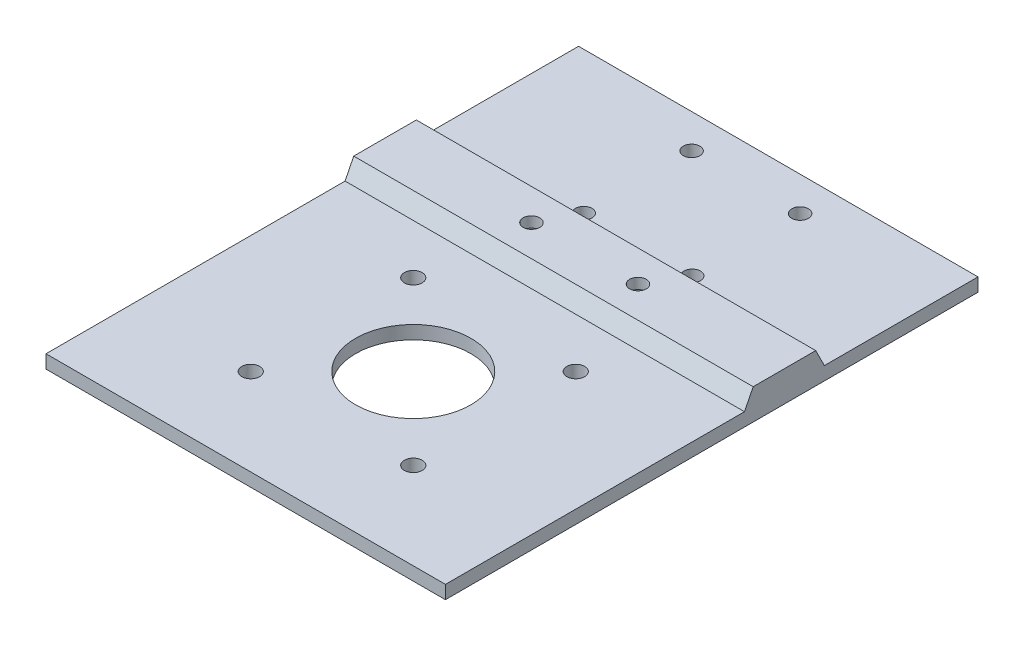
ISO-10303-21;
HEADER;
FILE_DESCRIPTION(('STEP AP214'),'2;1');
FILE_NAME('part.step','',(''),(''),'','','');
FILE_SCHEMA(('AUTOMOTIVE_DESIGN { 1 0 10303 214 1 1 1 1 }'));
ENDSEC;
DATA;
#1=APPLICATION_CONTEXT('core data for automotive mechanical design processes');
#2=APPLICATION_PROTOCOL_DEFINITION('international standard','automotive_design',2000,#1);
#3=PRODUCT_CONTEXT('',#1,'mechanical');
#4=PRODUCT('Part','Part','',(#3));
#5=PRODUCT_RELATED_PRODUCT_CATEGORY('part','',(#4));
#6=PRODUCT_DEFINITION_FORMATION('','',#4);
#7=PRODUCT_DEFINITION_CONTEXT('part definition',#1,'design');
#8=PRODUCT_DEFINITION('design','',#6,#7);
#9=PRODUCT_DEFINITION_SHAPE('','',#8);
#10=(LENGTH_UNIT() NAMED_UNIT(*) SI_UNIT(.MILLI.,.METRE.));
#11=(NAMED_UNIT(*) PLANE_ANGLE_UNIT() SI_UNIT($,.RADIAN.));
#12=(NAMED_UNIT(*) SI_UNIT($,.STERADIAN.) SOLID_ANGLE_UNIT());
#13=UNCERTAINTY_MEASURE_WITH_UNIT(LENGTH_MEASURE(1.E-05),#10,'distance_accuracy_value','');
#14=(GEOMETRIC_REPRESENTATION_CONTEXT(3) GLOBAL_UNCERTAINTY_ASSIGNED_CONTEXT((#13)) GLOBAL_UNIT_ASSIGNED_CONTEXT((#10,
#11,#12)) REPRESENTATION_CONTEXT('',''));
#15=CARTESIAN_POINT('',(0.,0.,0.));
#16=DIRECTION('',(0.,0.,1.));
#17=DIRECTION('',(1.,0.,0.));
#18=AXIS2_PLACEMENT_3D('',#15,#16,#17);
#19=CARTESIAN_POINT('',(0.,2.54,0.));
#20=DIRECTION('',(0.,-1.,0.));
#21=DIRECTION('',(0.,0.,-1.));
#22=AXIS2_PLACEMENT_3D('',#19,#20,#21);
#23=PLANE('',#22);
#24=CARTESIAN_POINT('',(10.6671992353835,2.54,-44.2920663903966));
#25=DIRECTION('',(0.,1.,0.));
#26=DIRECTION('',(0.,0.,1.));
#27=AXIS2_PLACEMENT_3D('',#24,#25,#26);
#28=CIRCLE('',#27,1.5875);
#29=CARTESIAN_POINT('',(10.6671992353835,2.54,-42.7045663903966));
#30=VERTEX_POINT('',#29);
#31=EDGE_CURVE('E205',#30,#30,#28,.T.);
#32=ORIENTED_EDGE('',*,*,#31,.F.);
#33=EDGE_LOOP('',(#32));
#34=FACE_BOUND('',#33,.T.);
#35=CARTESIAN_POINT('',(10.6671992353835,2.54,-23.7165663903966));
#36=DIRECTION('',(0.,1.,0.));
#37=DIRECTION('',(0.,0.,1.));
#38=AXIS2_PLACEMENT_3D('',#35,#36,#37);
#39=CIRCLE('',#38,1.5875);
#40=CARTESIAN_POINT('',(10.6671992353835,2.54,-22.1290663903966));
#41=VERTEX_POINT('',#40);
#42=EDGE_CURVE('E215',#41,#41,#39,.T.);
#43=ORIENTED_EDGE('',*,*,#42,.F.);
#44=EDGE_LOOP('',(#43));
#45=FACE_BOUND('',#44,.T.);
#46=CARTESIAN_POINT('',(-10.0338007646165,2.54,-23.7165663903966));
#47=DIRECTION('',(0.,1.,0.));
#48=DIRECTION('',(0.,0.,1.));
#49=AXIS2_PLACEMENT_3D('',#46,#47,#48);
#50=CIRCLE('',#49,1.5875);
#51=CARTESIAN_POINT('',(-10.0338007646165,2.54,-22.1290663903966));
#52=VERTEX_POINT('',#51);
#53=EDGE_CURVE('E223',#52,#52,#50,.T.);
#54=ORIENTED_EDGE('',*,*,#53,.F.);
#55=EDGE_LOOP('',(#54));
#56=FACE_BOUND('',#55,.T.);
#57=CARTESIAN_POINT('',(-10.0338007646165,2.54,-44.2920663903966));
#58=DIRECTION('',(0.,1.,0.));
#59=DIRECTION('',(0.,0.,1.));
#60=AXIS2_PLACEMENT_3D('',#57,#58,#59);
#61=CIRCLE('',#60,1.5875);
#62=CARTESIAN_POINT('',(-10.0338007646165,2.54,-42.7045663903966));
#63=VERTEX_POINT('',#62);
#64=EDGE_CURVE('E214',#63,#63,#61,.T.);
#65=ORIENTED_EDGE('',*,*,#64,.F.);
#66=EDGE_LOOP('',(#65));
#67=FACE_BOUND('',#66,.T.);
#68=DIRECTION('',(-1.,0.,0.));
#69=VECTOR('',#68,1.);
#70=CARTESIAN_POINT('',(53.6936142058216,2.54000000000001,-21.4940663903966));
#71=LINE('',#70,#69);
#72=CARTESIAN_POINT('',(38.1,2.54000000000001,-21.4940663903966));
#73=VERTEX_POINT('',#72);
#74=CARTESIAN_POINT('',(-38.1,2.54000000000001,-21.4940663903966));
#75=VERTEX_POINT('',#74);
#76=EDGE_CURVE('E151',#73,#75,#71,.T.);
#77=ORIENTED_EDGE('',*,*,#76,.F.);
#78=DIRECTION('',(0.,0.,-1.));
#79=VECTOR('',#78,1.);
#80=CARTESIAN_POINT('',(38.1,2.54,50.8));
#81=LINE('',#80,#79);
#82=CARTESIAN_POINT('',(38.1,2.54,-50.8));
#83=VERTEX_POINT('',#82);
#84=EDGE_CURVE('E98',#73,#83,#81,.T.);
#85=ORIENTED_EDGE('',*,*,#84,.T.);
#86=DIRECTION('',(-1.,0.,0.));
#87=VECTOR('',#86,1.);
#88=CARTESIAN_POINT('',(-38.1,2.54,-50.8));
#89=LINE('',#88,#87);
#90=CARTESIAN_POINT('',(-38.1,2.54,-50.8));
#91=VERTEX_POINT('',#90);
#92=EDGE_CURVE('E248',#83,#91,#89,.T.);
#93=ORIENTED_EDGE('',*,*,#92,.T.);
#94=DIRECTION('',(0.,0.,1.));
#95=VECTOR('',#94,1.);
#96=CARTESIAN_POINT('',(-38.1,2.54,50.8));
#97=LINE('',#96,#95);
#98=EDGE_CURVE('E252',#91,#75,#97,.T.);
#99=ORIENTED_EDGE('',*,*,#98,.T.);
#100=EDGE_LOOP('',(#77,#85,#93,#99));
#101=FACE_BOUND('',#100,.T.);
#102=ADVANCED_FACE('F39',(#34,#45,#56,#67,#101),#23,.F.);
#103=CARTESIAN_POINT('',(38.1,2.54,50.8));
#104=DIRECTION('',(-1.,0.,0.));
#105=DIRECTION('',(0.,0.,1.));
#106=AXIS2_PLACEMENT_3D('',#103,#104,#105);
#107=PLANE('',#106);
#108=DIRECTION('',(0.,0.,-1.));
#109=VECTOR('',#108,1.);
#110=CARTESIAN_POINT('',(38.1,0.,50.8));
#111=LINE('',#110,#109);
#112=CARTESIAN_POINT('',(38.1,0.,50.8));
#113=VERTEX_POINT('',#112);
#114=CARTESIAN_POINT('',(38.1,0.,-50.8));
#115=VERTEX_POINT('',#114);
#116=EDGE_CURVE('E244',#113,#115,#111,.T.);
#117=ORIENTED_EDGE('',*,*,#116,.T.);
#118=DIRECTION('',(0.,-1.,0.));
#119=VECTOR('',#118,1.);
#120=CARTESIAN_POINT('',(38.1,2.54,-50.8));
#121=LINE('',#120,#119);
#122=EDGE_CURVE('E11',#83,#115,#121,.T.);
#123=ORIENTED_EDGE('',*,*,#122,.F.);
#124=ORIENTED_EDGE('',*,*,#84,.F.);
#125=DIRECTION('',(0.,-0.894427190999916,-0.447213595499959));
#126=VECTOR('',#125,1.);
#127=CARTESIAN_POINT('',(38.1,2.54000000000001,-21.4940663903966));
#128=LINE('',#127,#126);
#129=CARTESIAN_POINT('',(38.1,5.84200000000001,-19.8430663903966));
#130=VERTEX_POINT('',#129);
#131=EDGE_CURVE('E161',#130,#73,#128,.T.);
#132=ORIENTED_EDGE('',*,*,#131,.F.);
#133=DIRECTION('',(0.,0.,-1.));
#134=VECTOR('',#133,1.);
#135=CARTESIAN_POINT('',(38.1,5.84200000000001,-19.8430663903966));
#136=LINE('',#135,#134);
#137=CARTESIAN_POINT('',(38.1,5.842,-7.90506639039663));
#138=VERTEX_POINT('',#137);
#139=EDGE_CURVE('E134',#138,#130,#136,.T.);
#140=ORIENTED_EDGE('',*,*,#139,.F.);
#141=DIRECTION('',(0.,0.894427190999916,-0.447213595499958));
#142=VECTOR('',#141,1.);
#143=CARTESIAN_POINT('',(38.1,5.842,-7.90506639039663));
#144=LINE('',#143,#142);
#145=CARTESIAN_POINT('',(38.1,2.54,-6.25406639039663));
#146=VERTEX_POINT('',#145);
#147=EDGE_CURVE('E138',#146,#138,#144,.T.);
#148=ORIENTED_EDGE('',*,*,#147,.F.);
#149=CARTESIAN_POINT('',(38.1,2.54,50.8));
#150=VERTEX_POINT('',#149);
#151=EDGE_CURVE('E245',#150,#146,#81,.T.);
#152=ORIENTED_EDGE('',*,*,#151,.F.);
#153=DIRECTION('',(0.,-1.,0.));
#154=VECTOR('',#153,1.);
#155=CARTESIAN_POINT('',(38.1,2.54,50.8));
#156=LINE('',#155,#154);
#157=EDGE_CURVE('E256',#150,#113,#156,.T.);
#158=ORIENTED_EDGE('',*,*,#157,.T.);
#159=EDGE_LOOP('',(#117,#123,#124,#132,#140,#148,#152,#158));
#160=FACE_BOUND('',#159,.T.);
#161=ADVANCED_FACE('F41',(#160),#107,.F.);
#162=CARTESIAN_POINT('',(-38.1,2.54,-50.8));
#163=DIRECTION('',(0.,0.,1.));
#164=DIRECTION('',(1.,0.,0.));
#165=AXIS2_PLACEMENT_3D('',#162,#163,#164);
#166=PLANE('',#165);
#167=DIRECTION('',(-1.,0.,0.));
#168=VECTOR('',#167,1.);
#169=CARTESIAN_POINT('',(-38.1,0.,-50.8));
#170=LINE('',#169,#168);
#171=CARTESIAN_POINT('',(-38.1,0.,-50.8));
#172=VERTEX_POINT('',#171);
#173=EDGE_CURVE('E260',#115,#172,#170,.T.);
#174=ORIENTED_EDGE('',*,*,#173,.T.);
#175=DIRECTION('',(0.,-1.,0.));
#176=VECTOR('',#175,1.);
#177=CARTESIAN_POINT('',(-38.1,2.54,-50.8));
#178=LINE('',#177,#176);
#179=EDGE_CURVE('E47',#91,#172,#178,.T.);
#180=ORIENTED_EDGE('',*,*,#179,.F.);
#181=ORIENTED_EDGE('',*,*,#92,.F.);
#182=ORIENTED_EDGE('',*,*,#122,.T.);
#183=EDGE_LOOP('',(#174,#180,#181,#182));
#184=FACE_BOUND('',#183,.T.);
#185=ADVANCED_FACE('F365',(#184),#166,.F.);
#186=CARTESIAN_POINT('',(-38.1,2.54,50.8));
#187=DIRECTION('',(1.,0.,0.));
#188=DIRECTION('',(0.,0.,-1.));
#189=AXIS2_PLACEMENT_3D('',#186,#187,#188);
#190=PLANE('',#189);
#191=DIRECTION('',(0.,0.,1.));
#192=VECTOR('',#191,1.);
#193=CARTESIAN_POINT('',(-38.1,0.,50.8));
#194=LINE('',#193,#192);
#195=CARTESIAN_POINT('',(-38.1,0.,50.8));
#196=VERTEX_POINT('',#195);
#197=EDGE_CURVE('E263',#172,#196,#194,.T.);
#198=ORIENTED_EDGE('',*,*,#197,.T.);
#199=DIRECTION('',(0.,-1.,0.));
#200=VECTOR('',#199,1.);
#201=CARTESIAN_POINT('',(-38.1,2.54,50.8));
#202=LINE('',#201,#200);
#203=CARTESIAN_POINT('',(-38.1,2.54,50.8));
#204=VERTEX_POINT('',#203);
#205=EDGE_CURVE('E269',#204,#196,#202,.T.);
#206=ORIENTED_EDGE('',*,*,#205,.F.);
#207=CARTESIAN_POINT('',(-38.1,2.54,-6.25406639039663));
#208=VERTEX_POINT('',#207);
#209=EDGE_CURVE('E251',#208,#204,#97,.T.);
#210=ORIENTED_EDGE('',*,*,#209,.F.);
#211=DIRECTION('',(0.,-0.894427190999916,0.447213595499958));
#212=VECTOR('',#211,1.);
#213=CARTESIAN_POINT('',(-38.1,5.842,-7.90506639039663));
#214=LINE('',#213,#212);
#215=CARTESIAN_POINT('',(-38.1,5.842,-7.90506639039663));
#216=VERTEX_POINT('',#215);
#217=EDGE_CURVE('E57',#216,#208,#214,.T.);
#218=ORIENTED_EDGE('',*,*,#217,.F.);
#219=DIRECTION('',(0.,0.,1.));
#220=VECTOR('',#219,1.);
#221=CARTESIAN_POINT('',(-38.1,5.84200000000001,-19.8430663903966));
#222=LINE('',#221,#220);
#223=CARTESIAN_POINT('',(-38.1,5.84200000000001,-19.8430663903966));
#224=VERTEX_POINT('',#223);
#225=EDGE_CURVE('E133',#224,#216,#222,.T.);
#226=ORIENTED_EDGE('',*,*,#225,.F.);
#227=DIRECTION('',(0.,0.894427190999915,0.447213595499959));
#228=VECTOR('',#227,1.);
#229=CARTESIAN_POINT('',(-38.1,2.54000000000001,-21.4940663903966));
#230=LINE('',#229,#228);
#231=EDGE_CURVE('E145',#75,#224,#230,.T.);
#232=ORIENTED_EDGE('',*,*,#231,.F.);
#233=ORIENTED_EDGE('',*,*,#98,.F.);
#234=ORIENTED_EDGE('',*,*,#179,.T.);
#235=EDGE_LOOP('',(#198,#206,#210,#218,#226,#232,#233,#234));
#236=FACE_BOUND('',#235,.T.);
#237=ADVANCED_FACE('F143',(#236),#190,.F.);
#238=CARTESIAN_POINT('',(-38.1,2.54,50.8));
#239=DIRECTION('',(0.,0.,-1.));
#240=DIRECTION('',(-1.,0.,0.));
#241=AXIS2_PLACEMENT_3D('',#238,#239,#240);
#242=PLANE('',#241);
#243=DIRECTION('',(1.,0.,0.));
#244=VECTOR('',#243,1.);
#245=CARTESIAN_POINT('',(-38.1,0.,50.8));
#246=LINE('',#245,#244);
#247=EDGE_CURVE('E90',#196,#113,#246,.T.);
#248=ORIENTED_EDGE('',*,*,#247,.T.);
#249=ORIENTED_EDGE('',*,*,#157,.F.);
#250=DIRECTION('',(1.,0.,0.));
#251=VECTOR('',#250,1.);
#252=CARTESIAN_POINT('',(-38.1,2.54,50.8));
#253=LINE('',#252,#251);
#254=EDGE_CURVE('E66',#204,#150,#253,.T.);
#255=ORIENTED_EDGE('',*,*,#254,.F.);
#256=ORIENTED_EDGE('',*,*,#205,.T.);
#257=EDGE_LOOP('',(#248,#249,#255,#256));
#258=FACE_BOUND('',#257,.T.);
#259=ADVANCED_FACE('F283',(#258),#242,.F.);
#260=CARTESIAN_POINT('',(-15.6299951594772,2.54,3.20781358268962));
#261=DIRECTION('',(0.,1.,0.));
#262=DIRECTION('',(0.,0.,1.));
#263=AXIS2_PLACEMENT_3D('',#260,#261,#262);
#264=CIRCLE('',#263,1.70053);
#265=CARTESIAN_POINT('',(-15.6299951594772,2.54,4.90834358268961));
#266=VERTEX_POINT('',#265);
#267=EDGE_CURVE('E182',#266,#266,#264,.T.);
#268=ORIENTED_EDGE('',*,*,#267,.F.);
#269=EDGE_LOOP('',(#268));
#270=FACE_BOUND('',#269,.T.);
#271=CARTESIAN_POINT('',(15.3707048405228,2.54,3.20781358268961));
#272=DIRECTION('',(0.,1.,0.));
#273=DIRECTION('',(0.,0.,1.));
#274=AXIS2_PLACEMENT_3D('',#271,#272,#273);
#275=CIRCLE('',#274,1.70053);
#276=CARTESIAN_POINT('',(15.3707048405228,2.54,4.90834358268961));
#277=VERTEX_POINT('',#276);
#278=EDGE_CURVE('E173',#277,#277,#275,.T.);
#279=ORIENTED_EDGE('',*,*,#278,.F.);
#280=EDGE_LOOP('',(#279));
#281=FACE_BOUND('',#280,.T.);
#282=CARTESIAN_POINT('',(15.3707048405228,2.54,34.2085135826896));
#283=DIRECTION('',(0.,1.,0.));
#284=DIRECTION('',(0.,0.,1.));
#285=AXIS2_PLACEMENT_3D('',#282,#283,#284);
#286=CIRCLE('',#285,1.70053);
#287=CARTESIAN_POINT('',(15.3707048405228,2.54,35.9090435826896));
#288=VERTEX_POINT('',#287);
#289=EDGE_CURVE('E183',#288,#288,#286,.T.);
#290=ORIENTED_EDGE('',*,*,#289,.F.);
#291=EDGE_LOOP('',(#290));
#292=FACE_BOUND('',#291,.T.);
#293=CARTESIAN_POINT('',(-15.6299951594772,2.54,34.2085135826896));
#294=DIRECTION('',(0.,1.,0.));
#295=DIRECTION('',(0.,0.,1.));
#296=AXIS2_PLACEMENT_3D('',#293,#294,#295);
#297=CIRCLE('',#296,1.70052999999999);
#298=CARTESIAN_POINT('',(-15.6299951594772,2.54,35.9090435826896));
#299=VERTEX_POINT('',#298);
#300=EDGE_CURVE('E190',#299,#299,#297,.T.);
#301=ORIENTED_EDGE('',*,*,#300,.F.);
#302=EDGE_LOOP('',(#301));
#303=FACE_BOUND('',#302,.T.);
#304=CARTESIAN_POINT('',(-0.129645159477229,2.54,18.7081635826896));
#305=DIRECTION('',(0.,1.,0.));
#306=DIRECTION('',(0.,0.,1.));
#307=AXIS2_PLACEMENT_3D('',#304,#305,#306);
#308=CIRCLE('',#307,10.99947);
#309=CARTESIAN_POINT('',(-0.129645159477229,2.54,29.7076335826896));
#310=VERTEX_POINT('',#309);
#311=EDGE_CURVE('E198',#310,#310,#308,.T.);
#312=ORIENTED_EDGE('',*,*,#311,.F.);
#313=EDGE_LOOP('',(#312));
#314=FACE_BOUND('',#313,.T.);
#315=ORIENTED_EDGE('',*,*,#151,.T.);
#316=DIRECTION('',(-1.,0.,0.));
#317=VECTOR('',#316,1.);
#318=CARTESIAN_POINT('',(53.6936142058216,2.54,-6.25406639039663));
#319=LINE('',#318,#317);
#320=EDGE_CURVE('E168',#146,#208,#319,.T.);
#321=ORIENTED_EDGE('',*,*,#320,.T.);
#322=ORIENTED_EDGE('',*,*,#209,.T.);
#323=ORIENTED_EDGE('',*,*,#254,.T.);
#324=EDGE_LOOP('',(#315,#321,#322,#323));
#325=FACE_BOUND('',#324,.T.);
#326=ADVANCED_FACE('F325',(#270,#281,#292,#303,#314,#325),#23,.F.);
#327=CARTESIAN_POINT('',(0.,0.,0.));
#328=DIRECTION('',(0.,-1.,0.));
#329=DIRECTION('',(0.,0.,-1.));
#330=AXIS2_PLACEMENT_3D('',#327,#328,#329);
#331=PLANE('',#330);
#332=CARTESIAN_POINT('',(-10.16,0.,-13.8740663903966));
#333=DIRECTION('',(0.,-1.,0.));
#334=DIRECTION('',(0.,0.,-1.));
#335=AXIS2_PLACEMENT_3D('',#332,#333,#334);
#336=CIRCLE('',#335,3.175);
#337=CARTESIAN_POINT('',(-10.16,0.,-17.0490663903966));
#338=VERTEX_POINT('',#337);
#339=EDGE_CURVE('E158',#338,#338,#336,.T.);
#340=ORIENTED_EDGE('',*,*,#339,.F.);
#341=EDGE_LOOP('',(#340));
#342=FACE_BOUND('',#341,.T.);
#343=CARTESIAN_POINT('',(10.16,0.,-13.8740663903966));
#344=DIRECTION('',(0.,-1.,0.));
#345=DIRECTION('',(0.,0.,-1.));
#346=AXIS2_PLACEMENT_3D('',#343,#344,#345);
#347=CIRCLE('',#346,3.175);
#348=CARTESIAN_POINT('',(10.16,0.,-17.0490663903966));
#349=VERTEX_POINT('',#348);
#350=EDGE_CURVE('E297',#349,#349,#347,.T.);
#351=ORIENTED_EDGE('',*,*,#350,.F.);
#352=EDGE_LOOP('',(#351));
#353=FACE_BOUND('',#352,.T.);
#354=CARTESIAN_POINT('',(10.6671992353835,0.,-44.2920663903966));
#355=DIRECTION('',(0.,-1.,0.));
#356=DIRECTION('',(0.,0.,-1.));
#357=AXIS2_PLACEMENT_3D('',#354,#355,#356);
#358=CIRCLE('',#357,1.5875);
#359=CARTESIAN_POINT('',(10.6671992353835,0.,-45.8795663903966));
#360=VERTEX_POINT('',#359);
#361=EDGE_CURVE('E209',#360,#360,#358,.F.);
#362=ORIENTED_EDGE('',*,*,#361,.T.);
#363=EDGE_LOOP('',(#362));
#364=FACE_BOUND('',#363,.T.);
#365=CARTESIAN_POINT('',(10.6671992353835,0.,-23.7165663903966));
#366=DIRECTION('',(0.,-1.,0.));
#367=DIRECTION('',(0.,0.,-1.));
#368=AXIS2_PLACEMENT_3D('',#365,#366,#367);
#369=CIRCLE('',#368,1.5875);
#370=CARTESIAN_POINT('',(10.6671992353835,0.,-25.3040663903966));
#371=VERTEX_POINT('',#370);
#372=EDGE_CURVE('E210',#371,#371,#369,.F.);
#373=ORIENTED_EDGE('',*,*,#372,.T.);
#374=EDGE_LOOP('',(#373));
#375=FACE_BOUND('',#374,.T.);
#376=CARTESIAN_POINT('',(-10.0338007646165,0.,-23.7165663903966));
#377=DIRECTION('',(0.,-1.,0.));
#378=DIRECTION('',(0.,0.,-1.));
#379=AXIS2_PLACEMENT_3D('',#376,#377,#378);
#380=CIRCLE('',#379,1.5875);
#381=CARTESIAN_POINT('',(-10.0338007646165,0.,-25.3040663903966));
#382=VERTEX_POINT('',#381);
#383=EDGE_CURVE('E219',#382,#382,#380,.F.);
#384=ORIENTED_EDGE('',*,*,#383,.T.);
#385=EDGE_LOOP('',(#384));
#386=FACE_BOUND('',#385,.T.);
#387=CARTESIAN_POINT('',(-15.6299951594772,0.,3.20781358268962));
#388=DIRECTION('',(0.,-1.,0.));
#389=DIRECTION('',(0.,0.,-1.));
#390=AXIS2_PLACEMENT_3D('',#387,#388,#389);
#391=CIRCLE('',#390,1.70053);
#392=CARTESIAN_POINT('',(-15.6299951594772,0.,1.50728358268962));
#393=VERTEX_POINT('',#392);
#394=EDGE_CURVE('E227',#393,#393,#391,.F.);
#395=ORIENTED_EDGE('',*,*,#394,.T.);
#396=EDGE_LOOP('',(#395));
#397=FACE_BOUND('',#396,.T.);
#398=CARTESIAN_POINT('',(15.3707048405228,0.,3.20781358268961));
#399=DIRECTION('',(0.,-1.,0.));
#400=DIRECTION('',(0.,0.,-1.));
#401=AXIS2_PLACEMENT_3D('',#398,#399,#400);
#402=CIRCLE('',#401,1.70053);
#403=CARTESIAN_POINT('',(15.3707048405228,0.,1.50728358268961));
#404=VERTEX_POINT('',#403);
#405=EDGE_CURVE('E177',#404,#404,#402,.F.);
#406=ORIENTED_EDGE('',*,*,#405,.T.);
#407=EDGE_LOOP('',(#406));
#408=FACE_BOUND('',#407,.T.);
#409=CARTESIAN_POINT('',(15.3707048405228,0.,34.2085135826896));
#410=DIRECTION('',(0.,-1.,0.));
#411=DIRECTION('',(0.,0.,-1.));
#412=AXIS2_PLACEMENT_3D('',#409,#410,#411);
#413=CIRCLE('',#412,1.70053);
#414=CARTESIAN_POINT('',(15.3707048405228,0.,32.5079835826896));
#415=VERTEX_POINT('',#414);
#416=EDGE_CURVE('E178',#415,#415,#413,.F.);
#417=ORIENTED_EDGE('',*,*,#416,.T.);
#418=EDGE_LOOP('',(#417));
#419=FACE_BOUND('',#418,.T.);
#420=CARTESIAN_POINT('',(-15.6299951594772,0.,34.2085135826896));
#421=DIRECTION('',(0.,-1.,0.));
#422=DIRECTION('',(0.,0.,-1.));
#423=AXIS2_PLACEMENT_3D('',#420,#421,#422);
#424=CIRCLE('',#423,1.70052999999999);
#425=CARTESIAN_POINT('',(-15.6299951594772,0.,32.5079835826896));
#426=VERTEX_POINT('',#425);
#427=EDGE_CURVE('E186',#426,#426,#424,.F.);
#428=ORIENTED_EDGE('',*,*,#427,.T.);
#429=EDGE_LOOP('',(#428));
#430=FACE_BOUND('',#429,.T.);
#431=CARTESIAN_POINT('',(-0.129645159477229,0.,18.7081635826896));
#432=DIRECTION('',(0.,-1.,0.));
#433=DIRECTION('',(0.,0.,-1.));
#434=AXIS2_PLACEMENT_3D('',#431,#432,#433);
#435=CIRCLE('',#434,10.99947);
#436=CARTESIAN_POINT('',(-0.129645159477229,0.,7.70869358268961));
#437=VERTEX_POINT('',#436);
#438=EDGE_CURVE('E194',#437,#437,#435,.F.);
#439=ORIENTED_EDGE('',*,*,#438,.T.);
#440=EDGE_LOOP('',(#439));
#441=FACE_BOUND('',#440,.T.);
#442=CARTESIAN_POINT('',(-10.0338007646165,0.,-44.2920663903966));
#443=DIRECTION('',(0.,-1.,0.));
#444=DIRECTION('',(0.,0.,-1.));
#445=AXIS2_PLACEMENT_3D('',#442,#443,#444);
#446=CIRCLE('',#445,1.5875);
#447=CARTESIAN_POINT('',(-10.0338007646165,0.,-45.8795663903966));
#448=VERTEX_POINT('',#447);
#449=EDGE_CURVE('E240',#448,#448,#446,.F.);
#450=ORIENTED_EDGE('',*,*,#449,.T.);
#451=EDGE_LOOP('',(#450));
#452=FACE_BOUND('',#451,.T.);
#453=ORIENTED_EDGE('',*,*,#116,.F.);
#454=ORIENTED_EDGE('',*,*,#247,.F.);
#455=ORIENTED_EDGE('',*,*,#197,.F.);
#456=ORIENTED_EDGE('',*,*,#173,.F.);
#457=EDGE_LOOP('',(#453,#454,#455,#456));
#458=FACE_BOUND('',#457,.T.);
#459=ADVANCED_FACE('F279',(#342,#353,#364,#375,#386,#397,#408,#419,#430,#441,#452,#458),#331,.T.);
#460=CARTESIAN_POINT('',(-10.0338007646165,-31.111199305832,-44.2920663903966));
#461=DIRECTION('',(0.,1.,0.));
#462=DIRECTION('',(0.,0.,1.));
#463=AXIS2_PLACEMENT_3D('',#460,#461,#462);
#464=CYLINDRICAL_SURFACE('',#463,1.5875);
#465=ORIENTED_EDGE('',*,*,#64,.T.);
#466=EDGE_LOOP('',(#465));
#467=FACE_BOUND('',#466,.T.);
#468=ORIENTED_EDGE('',*,*,#449,.F.);
#469=EDGE_LOOP('',(#468));
#470=FACE_BOUND('',#469,.T.);
#471=ADVANCED_FACE('F324',(#467,#470),#464,.F.);
#472=CARTESIAN_POINT('',(-0.129645159477229,-31.111199305832,18.7081635826896));
#473=DIRECTION('',(0.,1.,0.));
#474=DIRECTION('',(0.,0.,1.));
#475=AXIS2_PLACEMENT_3D('',#472,#473,#474);
#476=CYLINDRICAL_SURFACE('',#475,10.99947);
#477=ORIENTED_EDGE('',*,*,#311,.T.);
#478=EDGE_LOOP('',(#477));
#479=FACE_BOUND('',#478,.T.);
#480=ORIENTED_EDGE('',*,*,#438,.F.);
#481=EDGE_LOOP('',(#480));
#482=FACE_BOUND('',#481,.T.);
#483=ADVANCED_FACE('F347',(#479,#482),#476,.F.);
#484=CARTESIAN_POINT('',(-15.6299951594772,-31.111199305832,34.2085135826896));
#485=DIRECTION('',(0.,1.,0.));
#486=DIRECTION('',(0.,0.,1.));
#487=AXIS2_PLACEMENT_3D('',#484,#485,#486);
#488=CYLINDRICAL_SURFACE('',#487,1.70052999999999);
#489=ORIENTED_EDGE('',*,*,#300,.T.);
#490=EDGE_LOOP('',(#489));
#491=FACE_BOUND('',#490,.T.);
#492=ORIENTED_EDGE('',*,*,#427,.F.);
#493=EDGE_LOOP('',(#492));
#494=FACE_BOUND('',#493,.T.);
#495=ADVANCED_FACE('F354',(#491,#494),#488,.F.);
#496=CARTESIAN_POINT('',(15.3707048405228,-31.111199305832,34.2085135826896));
#497=DIRECTION('',(0.,1.,0.));
#498=DIRECTION('',(0.,0.,1.));
#499=AXIS2_PLACEMENT_3D('',#496,#497,#498);
#500=CYLINDRICAL_SURFACE('',#499,1.70053);
#501=ORIENTED_EDGE('',*,*,#289,.T.);
#502=EDGE_LOOP('',(#501));
#503=FACE_BOUND('',#502,.T.);
#504=ORIENTED_EDGE('',*,*,#416,.F.);
#505=EDGE_LOOP('',(#504));
#506=FACE_BOUND('',#505,.T.);
#507=ADVANCED_FACE('F546',(#503,#506),#500,.F.);
#508=CARTESIAN_POINT('',(15.3707048405228,-31.111199305832,3.20781358268961));
#509=DIRECTION('',(0.,1.,0.));
#510=DIRECTION('',(0.,0.,1.));
#511=AXIS2_PLACEMENT_3D('',#508,#509,#510);
#512=CYLINDRICAL_SURFACE('',#511,1.70053);
#513=ORIENTED_EDGE('',*,*,#278,.T.);
#514=EDGE_LOOP('',(#513));
#515=FACE_BOUND('',#514,.T.);
#516=ORIENTED_EDGE('',*,*,#405,.F.);
#517=EDGE_LOOP('',(#516));
#518=FACE_BOUND('',#517,.T.);
#519=ADVANCED_FACE('F538',(#515,#518),#512,.F.);
#520=CARTESIAN_POINT('',(-15.6299951594772,-31.111199305832,3.20781358268962));
#521=DIRECTION('',(0.,1.,0.));
#522=DIRECTION('',(0.,0.,1.));
#523=AXIS2_PLACEMENT_3D('',#520,#521,#522);
#524=CYLINDRICAL_SURFACE('',#523,1.70053);
#525=ORIENTED_EDGE('',*,*,#267,.T.);
#526=EDGE_LOOP('',(#525));
#527=FACE_BOUND('',#526,.T.);
#528=ORIENTED_EDGE('',*,*,#394,.F.);
#529=EDGE_LOOP('',(#528));
#530=FACE_BOUND('',#529,.T.);
#531=ADVANCED_FACE('F529',(#527,#530),#524,.F.);
#532=CARTESIAN_POINT('',(-10.0338007646165,-31.111199305832,-23.7165663903966));
#533=DIRECTION('',(0.,1.,0.));
#534=DIRECTION('',(0.,0.,1.));
#535=AXIS2_PLACEMENT_3D('',#532,#533,#534);
#536=CYLINDRICAL_SURFACE('',#535,1.5875);
#537=ORIENTED_EDGE('',*,*,#53,.T.);
#538=EDGE_LOOP('',(#537));
#539=FACE_BOUND('',#538,.T.);
#540=ORIENTED_EDGE('',*,*,#383,.F.);
#541=EDGE_LOOP('',(#540));
#542=FACE_BOUND('',#541,.T.);
#543=ADVANCED_FACE('F520',(#539,#542),#536,.F.);
#544=CARTESIAN_POINT('',(10.6671992353835,-31.111199305832,-23.7165663903966));
#545=DIRECTION('',(0.,1.,0.));
#546=DIRECTION('',(0.,0.,1.));
#547=AXIS2_PLACEMENT_3D('',#544,#545,#546);
#548=CYLINDRICAL_SURFACE('',#547,1.5875);
#549=ORIENTED_EDGE('',*,*,#42,.T.);
#550=EDGE_LOOP('',(#549));
#551=FACE_BOUND('',#550,.T.);
#552=ORIENTED_EDGE('',*,*,#372,.F.);
#553=EDGE_LOOP('',(#552));
#554=FACE_BOUND('',#553,.T.);
#555=ADVANCED_FACE('F511',(#551,#554),#548,.F.);
#556=CARTESIAN_POINT('',(10.6671992353835,-31.111199305832,-44.2920663903966));
#557=DIRECTION('',(0.,1.,0.));
#558=DIRECTION('',(0.,0.,1.));
#559=AXIS2_PLACEMENT_3D('',#556,#557,#558);
#560=CYLINDRICAL_SURFACE('',#559,1.5875);
#561=ORIENTED_EDGE('',*,*,#31,.T.);
#562=EDGE_LOOP('',(#561));
#563=FACE_BOUND('',#562,.T.);
#564=ORIENTED_EDGE('',*,*,#361,.F.);
#565=EDGE_LOOP('',(#564));
#566=FACE_BOUND('',#565,.T.);
#567=ADVANCED_FACE('F399',(#563,#566),#560,.F.);
#568=CARTESIAN_POINT('',(53.6936142058216,5.842,-7.90506639039663));
#569=DIRECTION('',(0.,-0.447213595499958,-0.894427190999916));
#570=DIRECTION('',(0.,0.894427190999916,-0.447213595499958));
#571=AXIS2_PLACEMENT_3D('',#568,#569,#570);
#572=PLANE('',#571);
#573=ORIENTED_EDGE('',*,*,#320,.F.);
#574=ORIENTED_EDGE('',*,*,#147,.T.);
#575=DIRECTION('',(-1.,0.,0.));
#576=VECTOR('',#575,1.);
#577=CARTESIAN_POINT('',(53.6936142058216,5.842,-7.90506639039663));
#578=LINE('',#577,#576);
#579=EDGE_CURVE('E139',#138,#216,#578,.T.);
#580=ORIENTED_EDGE('',*,*,#579,.T.);
#581=ORIENTED_EDGE('',*,*,#217,.T.);
#582=EDGE_LOOP('',(#573,#574,#580,#581));
#583=FACE_BOUND('',#582,.T.);
#584=ADVANCED_FACE('F384',(#583),#572,.F.);
#585=CARTESIAN_POINT('',(53.6936142058216,5.84200000000001,-19.8430663903966));
#586=DIRECTION('',(0.,-1.,0.));
#587=DIRECTION('',(0.,0.,-1.));
#588=AXIS2_PLACEMENT_3D('',#585,#586,#587);
#589=PLANE('',#588);
#590=CARTESIAN_POINT('',(-10.16,5.84200000000001,-13.8740663903966));
#591=DIRECTION('',(0.,-1.,0.));
#592=DIRECTION('',(0.,0.,-1.));
#593=AXIS2_PLACEMENT_3D('',#590,#591,#592);
#594=CIRCLE('',#593,1.5875);
#595=CARTESIAN_POINT('',(-10.16,5.84200000000001,-15.4615663903966));
#596=VERTEX_POINT('',#595);
#597=EDGE_CURVE('E292',#596,#596,#594,.T.);
#598=ORIENTED_EDGE('',*,*,#597,.T.);
#599=EDGE_LOOP('',(#598));
#600=FACE_BOUND('',#599,.T.);
#601=CARTESIAN_POINT('',(10.16,5.84200000000001,-13.8740663903966));
#602=DIRECTION('',(0.,-1.,0.));
#603=DIRECTION('',(0.,0.,-1.));
#604=AXIS2_PLACEMENT_3D('',#601,#602,#603);
#605=CIRCLE('',#604,1.5875);
#606=CARTESIAN_POINT('',(10.16,5.84200000000001,-15.4615663903966));
#607=VERTEX_POINT('',#606);
#608=EDGE_CURVE('E293',#607,#607,#605,.T.);
#609=ORIENTED_EDGE('',*,*,#608,.T.);
#610=EDGE_LOOP('',(#609));
#611=FACE_BOUND('',#610,.T.);
#612=ORIENTED_EDGE('',*,*,#579,.F.);
#613=ORIENTED_EDGE('',*,*,#139,.T.);
#614=DIRECTION('',(-1.,0.,0.));
#615=VECTOR('',#614,1.);
#616=CARTESIAN_POINT('',(53.6936142058216,5.84200000000001,-19.8430663903966));
#617=LINE('',#616,#615);
#618=EDGE_CURVE('E129',#130,#224,#617,.T.);
#619=ORIENTED_EDGE('',*,*,#618,.T.);
#620=ORIENTED_EDGE('',*,*,#225,.T.);
#621=EDGE_LOOP('',(#612,#613,#619,#620));
#622=FACE_BOUND('',#621,.T.);
#623=ADVANCED_FACE('F132',(#600,#611,#622),#589,.F.);
#624=CARTESIAN_POINT('',(53.6936142058216,2.54000000000001,-21.4940663903966));
#625=DIRECTION('',(0.,-0.447213595499959,0.894427190999916));
#626=DIRECTION('',(0.,-0.894427190999916,-0.447213595499959));
#627=AXIS2_PLACEMENT_3D('',#624,#625,#626);
#628=PLANE('',#627);
#629=ORIENTED_EDGE('',*,*,#618,.F.);
#630=ORIENTED_EDGE('',*,*,#131,.T.);
#631=ORIENTED_EDGE('',*,*,#76,.T.);
#632=ORIENTED_EDGE('',*,*,#231,.T.);
#633=EDGE_LOOP('',(#629,#630,#631,#632));
#634=FACE_BOUND('',#633,.T.);
#635=ADVANCED_FACE('F150',(#634),#628,.F.);
#636=CARTESIAN_POINT('',(10.16,3.81,-13.8740663903966));
#637=DIRECTION('',(0.,-1.,0.));
#638=DIRECTION('',(0.,0.,-1.));
#639=AXIS2_PLACEMENT_3D('',#636,#637,#638);
#640=CYLINDRICAL_SURFACE('',#639,3.175);
#641=CARTESIAN_POINT('',(10.16,3.81,-13.8740663903966));
#642=DIRECTION('',(0.,-1.,0.));
#643=DIRECTION('',(0.,0.,-1.));
#644=AXIS2_PLACEMENT_3D('',#641,#642,#643);
#645=CIRCLE('',#644,3.175);
#646=CARTESIAN_POINT('',(10.16,3.81,-17.0490663903966));
#647=VERTEX_POINT('',#646);
#648=EDGE_CURVE('E300',#647,#647,#645,.T.);
#649=ORIENTED_EDGE('',*,*,#648,.F.);
#650=EDGE_LOOP('',(#649));
#651=FACE_BOUND('',#650,.T.);
#652=ORIENTED_EDGE('',*,*,#350,.T.);
#653=EDGE_LOOP('',(#652));
#654=FACE_BOUND('',#653,.T.);
#655=ADVANCED_FACE('F320',(#651,#654),#640,.F.);
#656=CARTESIAN_POINT('',(10.16,3.81,-13.8740663903966));
#657=DIRECTION('',(0.,-1.,0.));
#658=DIRECTION('',(0.,0.,-1.));
#659=AXIS2_PLACEMENT_3D('',#656,#657,#658);
#660=PLANE('',#659);
#661=CARTESIAN_POINT('',(10.16,3.81,-13.8740663903966));
#662=DIRECTION('',(0.,-1.,0.));
#663=DIRECTION('',(0.,0.,-1.));
#664=AXIS2_PLACEMENT_3D('',#661,#662,#663);
#665=CIRCLE('',#664,1.5875);
#666=CARTESIAN_POINT('',(10.16,3.81,-15.4615663903966));
#667=VERTEX_POINT('',#666);
#668=EDGE_CURVE('E303',#667,#667,#665,.T.);
#669=ORIENTED_EDGE('',*,*,#668,.F.);
#670=EDGE_LOOP('',(#669));
#671=FACE_BOUND('',#670,.T.);
#672=ORIENTED_EDGE('',*,*,#648,.T.);
#673=EDGE_LOOP('',(#672));
#674=FACE_BOUND('',#673,.T.);
#675=ADVANCED_FACE('F416',(#671,#674),#660,.T.);
#676=CARTESIAN_POINT('',(-10.16,3.81,-13.8740663903966));
#677=DIRECTION('',(0.,-1.,0.));
#678=DIRECTION('',(0.,0.,-1.));
#679=AXIS2_PLACEMENT_3D('',#676,#677,#678);
#680=CYLINDRICAL_SURFACE('',#679,3.175);
#681=CARTESIAN_POINT('',(-10.16,3.81,-13.8740663903966));
#682=DIRECTION('',(0.,-1.,0.));
#683=DIRECTION('',(0.,0.,-1.));
#684=AXIS2_PLACEMENT_3D('',#681,#682,#683);
#685=CIRCLE('',#684,3.175);
#686=CARTESIAN_POINT('',(-10.16,3.81,-17.0490663903966));
#687=VERTEX_POINT('',#686);
#688=EDGE_CURVE('E153',#687,#687,#685,.T.);
#689=ORIENTED_EDGE('',*,*,#688,.F.);
#690=EDGE_LOOP('',(#689));
#691=FACE_BOUND('',#690,.T.);
#692=ORIENTED_EDGE('',*,*,#339,.T.);
#693=EDGE_LOOP('',(#692));
#694=FACE_BOUND('',#693,.T.);
#695=ADVANCED_FACE('F425',(#691,#694),#680,.F.);
#696=CARTESIAN_POINT('',(-10.16,3.81,-13.8740663903966));
#697=DIRECTION('',(0.,-1.,0.));
#698=DIRECTION('',(0.,0.,-1.));
#699=AXIS2_PLACEMENT_3D('',#696,#697,#698);
#700=PLANE('',#699);
#701=CARTESIAN_POINT('',(-10.16,3.81,-13.8740663903966));
#702=DIRECTION('',(0.,-1.,0.));
#703=DIRECTION('',(0.,0.,-1.));
#704=AXIS2_PLACEMENT_3D('',#701,#702,#703);
#705=CIRCLE('',#704,1.5875);
#706=CARTESIAN_POINT('',(-10.16,3.81,-15.4615663903966));
#707=VERTEX_POINT('',#706);
#708=EDGE_CURVE('E289',#707,#707,#705,.T.);
#709=ORIENTED_EDGE('',*,*,#708,.F.);
#710=EDGE_LOOP('',(#709));
#711=FACE_BOUND('',#710,.T.);
#712=ORIENTED_EDGE('',*,*,#688,.T.);
#713=EDGE_LOOP('',(#712));
#714=FACE_BOUND('',#713,.T.);
#715=ADVANCED_FACE('F432',(#711,#714),#700,.T.);
#716=CARTESIAN_POINT('',(10.16,5.84200000000001,-13.8740663903966));
#717=DIRECTION('',(0.,-1.,0.));
#718=DIRECTION('',(0.,0.,-1.));
#719=AXIS2_PLACEMENT_3D('',#716,#717,#718);
#720=CYLINDRICAL_SURFACE('',#719,1.5875);
#721=ORIENTED_EDGE('',*,*,#608,.F.);
#722=EDGE_LOOP('',(#721));
#723=FACE_BOUND('',#722,.T.);
#724=ORIENTED_EDGE('',*,*,#668,.T.);
#725=EDGE_LOOP('',(#724));
#726=FACE_BOUND('',#725,.T.);
#727=ADVANCED_FACE('F438',(#723,#726),#720,.F.);
#728=CARTESIAN_POINT('',(-10.16,5.84200000000001,-13.8740663903966));
#729=DIRECTION('',(0.,-1.,0.));
#730=DIRECTION('',(0.,0.,-1.));
#731=AXIS2_PLACEMENT_3D('',#728,#729,#730);
#732=CYLINDRICAL_SURFACE('',#731,1.5875);
#733=ORIENTED_EDGE('',*,*,#597,.F.);
#734=EDGE_LOOP('',(#733));
#735=FACE_BOUND('',#734,.T.);
#736=ORIENTED_EDGE('',*,*,#708,.T.);
#737=EDGE_LOOP('',(#736));
#738=FACE_BOUND('',#737,.T.);
#739=ADVANCED_FACE('F445',(#735,#738),#732,.F.);
#740=CLOSED_SHELL('',(#102,#161,#185,#237,#259,#326,#459,#471,#483,#495,#507,#519,#531,#543,
#555,#567,#584,#623,#635,#655,#675,#695,#715,#727,#739));
#741=MANIFOLD_SOLID_BREP('B2',#740);
#742=ADVANCED_BREP_SHAPE_REPRESENTATION('',(#18,#741),#14);
#743=SHAPE_DEFINITION_REPRESENTATION(#9,#742);
ENDSEC;
END-ISO-10303-21;
